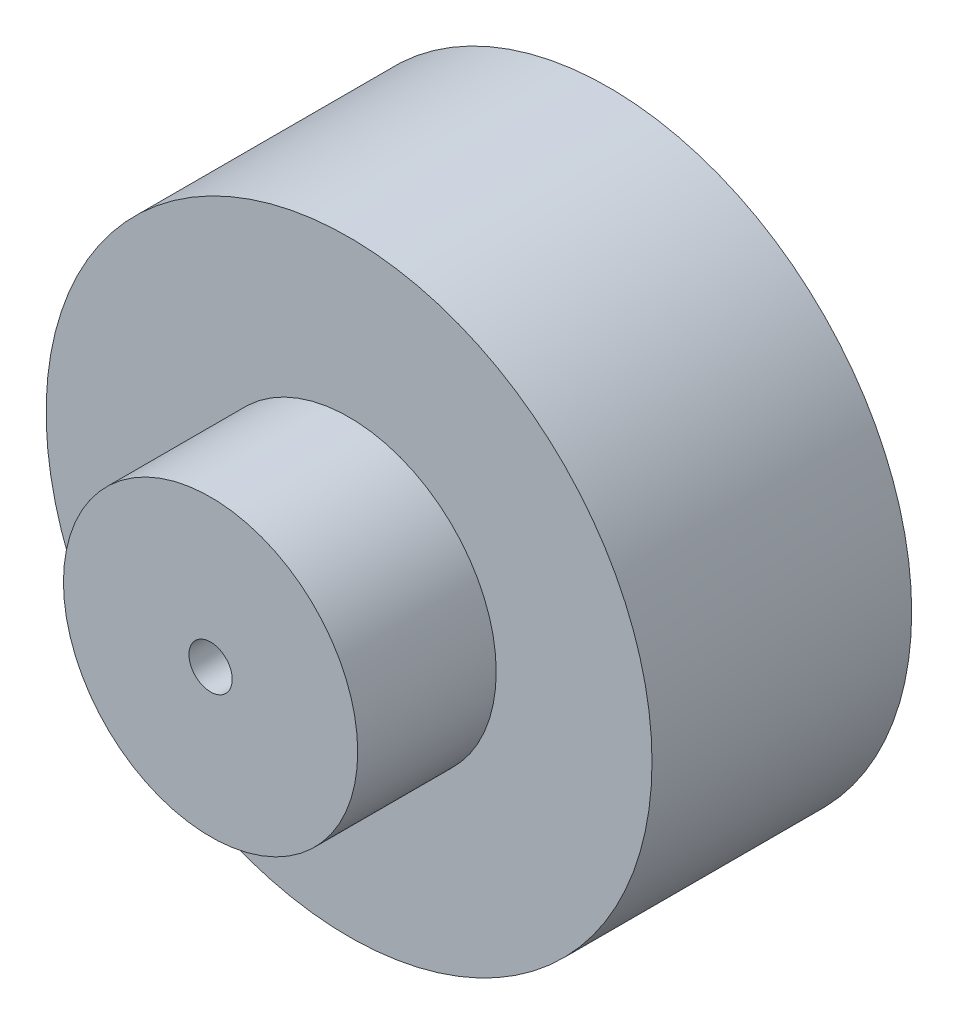
ISO-10303-21;
HEADER;
FILE_DESCRIPTION(('STEP AP214'),'2;1');
FILE_NAME('part.step','',(''),(''),'','','');
FILE_SCHEMA(('AUTOMOTIVE_DESIGN { 1 0 10303 214 1 1 1 1 }'));
ENDSEC;
DATA;
#1=APPLICATION_CONTEXT('core data for automotive mechanical design processes');
#2=APPLICATION_PROTOCOL_DEFINITION('international standard','automotive_design',2000,#1);
#3=PRODUCT_CONTEXT('',#1,'mechanical');
#4=PRODUCT('Part','Part','',(#3));
#5=PRODUCT_RELATED_PRODUCT_CATEGORY('part','',(#4));
#6=PRODUCT_DEFINITION_FORMATION('','',#4);
#7=PRODUCT_DEFINITION_CONTEXT('part definition',#1,'design');
#8=PRODUCT_DEFINITION('design','',#6,#7);
#9=PRODUCT_DEFINITION_SHAPE('','',#8);
#10=(LENGTH_UNIT() NAMED_UNIT(*) SI_UNIT(.MILLI.,.METRE.));
#11=(NAMED_UNIT(*) PLANE_ANGLE_UNIT() SI_UNIT($,.RADIAN.));
#12=(NAMED_UNIT(*) SI_UNIT($,.STERADIAN.) SOLID_ANGLE_UNIT());
#13=UNCERTAINTY_MEASURE_WITH_UNIT(LENGTH_MEASURE(1.E-05),#10,'distance_accuracy_value','');
#14=(GEOMETRIC_REPRESENTATION_CONTEXT(3) GLOBAL_UNCERTAINTY_ASSIGNED_CONTEXT((#13)) GLOBAL_UNIT_ASSIGNED_CONTEXT((#10,
#11,#12)) REPRESENTATION_CONTEXT('',''));
#15=CARTESIAN_POINT('',(0.,0.,0.));
#16=DIRECTION('',(0.,0.,1.));
#17=DIRECTION('',(1.,0.,0.));
#18=AXIS2_PLACEMENT_3D('',#15,#16,#17);
#19=CARTESIAN_POINT('',(0.,0.,15.));
#20=DIRECTION('',(0.,0.,-1.));
#21=DIRECTION('',(-1.,0.,0.));
#22=AXIS2_PLACEMENT_3D('',#19,#20,#21);
#23=CYLINDRICAL_SURFACE('',#22,17.5);
#24=CARTESIAN_POINT('',(0.,0.,15.));
#25=DIRECTION('',(0.,0.,1.));
#26=DIRECTION('',(1.,0.,0.));
#27=AXIS2_PLACEMENT_3D('',#24,#25,#26);
#28=CIRCLE('',#27,17.5);
#29=CARTESIAN_POINT('',(17.5,0.,15.));
#30=VERTEX_POINT('',#29);
#31=EDGE_CURVE('E10',#30,#30,#28,.T.);
#32=ORIENTED_EDGE('',*,*,#31,.F.);
#33=EDGE_LOOP('',(#32));
#34=FACE_BOUND('',#33,.T.);
#35=CARTESIAN_POINT('',(0.,0.,0.));
#36=DIRECTION('',(0.,0.,1.));
#37=DIRECTION('',(1.,0.,0.));
#38=AXIS2_PLACEMENT_3D('',#35,#36,#37);
#39=CIRCLE('',#38,17.5);
#40=CARTESIAN_POINT('',(17.5,0.,0.));
#41=VERTEX_POINT('',#40);
#42=EDGE_CURVE('E34',#41,#41,#39,.T.);
#43=ORIENTED_EDGE('',*,*,#42,.T.);
#44=EDGE_LOOP('',(#43));
#45=FACE_BOUND('',#44,.T.);
#46=ADVANCED_FACE('F31',(#34,#45),#23,.T.);
#47=CARTESIAN_POINT('',(0.,0.,15.));
#48=DIRECTION('',(0.,0.,1.));
#49=DIRECTION('',(1.,0.,0.));
#50=AXIS2_PLACEMENT_3D('',#47,#48,#49);
#51=PLANE('',#50);
#52=CARTESIAN_POINT('',(0.,0.,15.));
#53=DIRECTION('',(0.,0.,1.));
#54=DIRECTION('',(1.,0.,0.));
#55=AXIS2_PLACEMENT_3D('',#52,#53,#54);
#56=CIRCLE('',#55,8.5);
#57=CARTESIAN_POINT('',(8.5,0.,15.));
#58=VERTEX_POINT('',#57);
#59=EDGE_CURVE('E43',#58,#58,#56,.T.);
#60=ORIENTED_EDGE('',*,*,#59,.F.);
#61=EDGE_LOOP('',(#60));
#62=FACE_BOUND('',#61,.T.);
#63=ORIENTED_EDGE('',*,*,#31,.T.);
#64=EDGE_LOOP('',(#63));
#65=FACE_BOUND('',#64,.T.);
#66=ADVANCED_FACE('F76',(#62,#65),#51,.T.);
#67=CARTESIAN_POINT('',(0.,0.,0.));
#68=DIRECTION('',(0.,0.,1.));
#69=DIRECTION('',(1.,0.,0.));
#70=AXIS2_PLACEMENT_3D('',#67,#68,#69);
#71=PLANE('',#70);
#72=ORIENTED_EDGE('',*,*,#42,.F.);
#73=EDGE_LOOP('',(#72));
#74=FACE_BOUND('',#73,.T.);
#75=ADVANCED_FACE('F72',(#74),#71,.F.);
#76=CARTESIAN_POINT('',(0.,0.,23.));
#77=DIRECTION('',(0.,0.,-1.));
#78=DIRECTION('',(-1.,0.,0.));
#79=AXIS2_PLACEMENT_3D('',#76,#77,#78);
#80=CYLINDRICAL_SURFACE('',#79,8.5);
#81=CARTESIAN_POINT('',(0.,0.,23.));
#82=DIRECTION('',(0.,0.,1.));
#83=DIRECTION('',(1.,0.,0.));
#84=AXIS2_PLACEMENT_3D('',#81,#82,#83);
#85=CIRCLE('',#84,8.5);
#86=CARTESIAN_POINT('',(8.5,0.,23.));
#87=VERTEX_POINT('',#86);
#88=EDGE_CURVE('E41',#87,#87,#85,.T.);
#89=ORIENTED_EDGE('',*,*,#88,.F.);
#90=EDGE_LOOP('',(#89));
#91=FACE_BOUND('',#90,.T.);
#92=ORIENTED_EDGE('',*,*,#59,.T.);
#93=EDGE_LOOP('',(#92));
#94=FACE_BOUND('',#93,.T.);
#95=ADVANCED_FACE('F66',(#91,#94),#80,.T.);
#96=CARTESIAN_POINT('',(0.,0.,23.));
#97=DIRECTION('',(0.,0.,1.));
#98=DIRECTION('',(1.,0.,0.));
#99=AXIS2_PLACEMENT_3D('',#96,#97,#98);
#100=PLANE('',#99);
#101=CARTESIAN_POINT('',(0.,0.,23.));
#102=DIRECTION('',(0.,0.,1.));
#103=DIRECTION('',(1.,0.,0.));
#104=AXIS2_PLACEMENT_3D('',#101,#102,#103);
#105=CIRCLE('',#104,1.25);
#106=CARTESIAN_POINT('',(1.25,0.,23.));
#107=VERTEX_POINT('',#106);
#108=EDGE_CURVE('E49',#107,#107,#105,.T.);
#109=ORIENTED_EDGE('',*,*,#108,.F.);
#110=EDGE_LOOP('',(#109));
#111=FACE_BOUND('',#110,.T.);
#112=ORIENTED_EDGE('',*,*,#88,.T.);
#113=EDGE_LOOP('',(#112));
#114=FACE_BOUND('',#113,.T.);
#115=ADVANCED_FACE('F60',(#111,#114),#100,.T.);
#116=CARTESIAN_POINT('',(0.,0.,3.));
#117=DIRECTION('',(0.,0.,1.));
#118=DIRECTION('',(1.,0.,0.));
#119=AXIS2_PLACEMENT_3D('',#116,#117,#118);
#120=CYLINDRICAL_SURFACE('',#119,1.25);
#121=CARTESIAN_POINT('',(0.,0.,3.));
#122=DIRECTION('',(0.,0.,1.));
#123=DIRECTION('',(1.,0.,0.));
#124=AXIS2_PLACEMENT_3D('',#121,#122,#123);
#125=CIRCLE('',#124,1.25);
#126=CARTESIAN_POINT('',(1.25,0.,3.));
#127=VERTEX_POINT('',#126);
#128=EDGE_CURVE('E46',#127,#127,#125,.T.);
#129=ORIENTED_EDGE('',*,*,#128,.F.);
#130=EDGE_LOOP('',(#129));
#131=FACE_BOUND('',#130,.T.);
#132=ORIENTED_EDGE('',*,*,#108,.T.);
#133=EDGE_LOOP('',(#132));
#134=FACE_BOUND('',#133,.T.);
#135=ADVANCED_FACE('F57',(#131,#134),#120,.F.);
#136=CARTESIAN_POINT('',(0.,0.,3.));
#137=DIRECTION('',(0.,0.,1.));
#138=DIRECTION('',(1.,0.,0.));
#139=AXIS2_PLACEMENT_3D('',#136,#137,#138);
#140=PLANE('',#139);
#141=ORIENTED_EDGE('',*,*,#128,.T.);
#142=EDGE_LOOP('',(#141));
#143=FACE_BOUND('',#142,.T.);
#144=ADVANCED_FACE('F55',(#143),#140,.T.);
#145=CLOSED_SHELL('',(#46,#66,#75,#95,#115,#135,#144));
#146=MANIFOLD_SOLID_BREP('B2',#145);
#147=ADVANCED_BREP_SHAPE_REPRESENTATION('',(#18,#146),#14);
#148=SHAPE_DEFINITION_REPRESENTATION(#9,#147);
ENDSEC;
END-ISO-10303-21;
